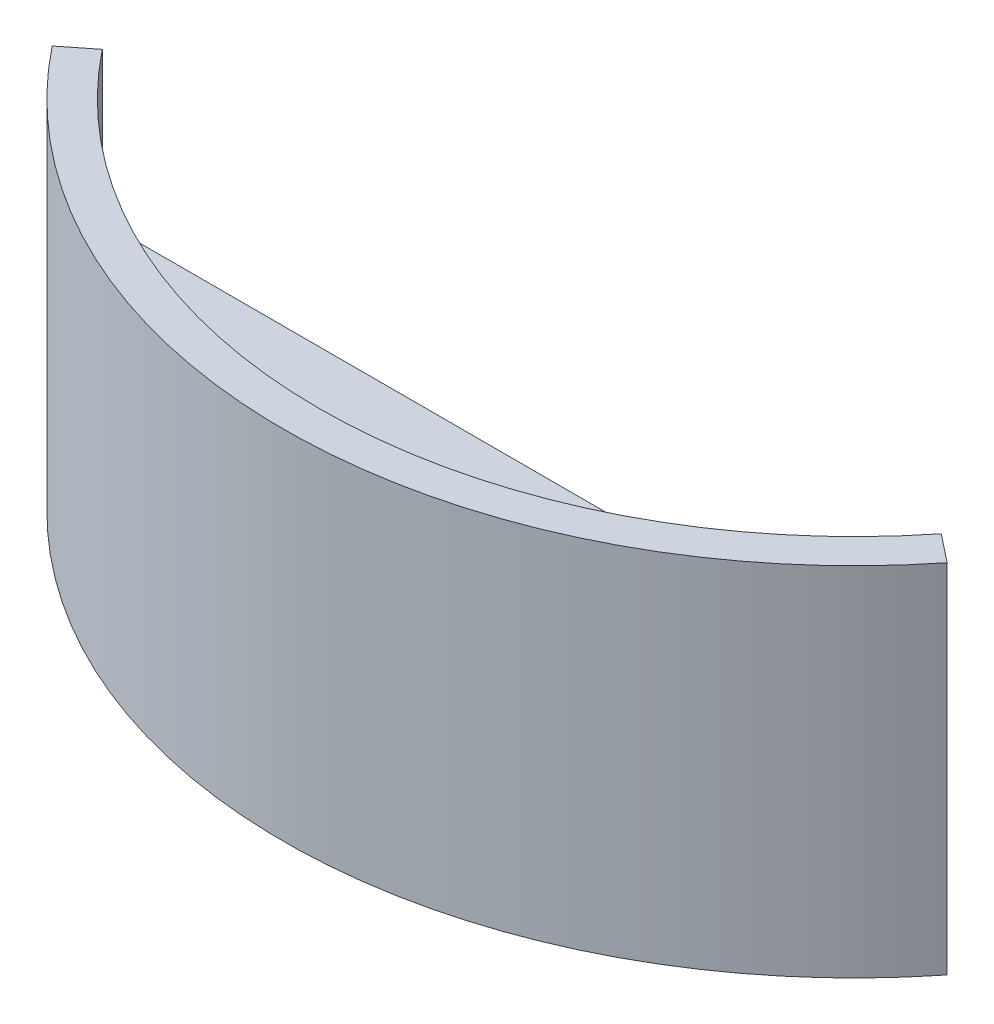
ISO-10303-21;
HEADER;
FILE_DESCRIPTION(('STEP AP214'),'2;1');
FILE_NAME('part.step','',(''),(''),'','','');
FILE_SCHEMA(('AUTOMOTIVE_DESIGN { 1 0 10303 214 1 1 1 1 }'));
ENDSEC;
DATA;
#1=APPLICATION_CONTEXT('core data for automotive mechanical design processes');
#2=APPLICATION_PROTOCOL_DEFINITION('international standard','automotive_design',2000,#1);
#3=PRODUCT_CONTEXT('',#1,'mechanical');
#4=PRODUCT('Part','Part','',(#3));
#5=PRODUCT_RELATED_PRODUCT_CATEGORY('part','',(#4));
#6=PRODUCT_DEFINITION_FORMATION('','',#4);
#7=PRODUCT_DEFINITION_CONTEXT('part definition',#1,'design');
#8=PRODUCT_DEFINITION('design','',#6,#7);
#9=PRODUCT_DEFINITION_SHAPE('','',#8);
#10=(LENGTH_UNIT() NAMED_UNIT(*) SI_UNIT(.MILLI.,.METRE.));
#11=(NAMED_UNIT(*) PLANE_ANGLE_UNIT() SI_UNIT($,.RADIAN.));
#12=(NAMED_UNIT(*) SI_UNIT($,.STERADIAN.) SOLID_ANGLE_UNIT());
#13=UNCERTAINTY_MEASURE_WITH_UNIT(LENGTH_MEASURE(1.E-05),#10,'distance_accuracy_value','');
#14=(GEOMETRIC_REPRESENTATION_CONTEXT(3) GLOBAL_UNCERTAINTY_ASSIGNED_CONTEXT((#13)) GLOBAL_UNIT_ASSIGNED_CONTEXT((#10,
#11,#12)) REPRESENTATION_CONTEXT('',''));
#15=CARTESIAN_POINT('',(0.,0.,0.));
#16=DIRECTION('',(0.,0.,1.));
#17=DIRECTION('',(1.,0.,0.));
#18=AXIS2_PLACEMENT_3D('',#15,#16,#17);
#19=CARTESIAN_POINT('',(0.,10.,-30.));
#20=DIRECTION('',(0.,-1.,0.));
#21=DIRECTION('',(0.,0.,-1.));
#22=AXIS2_PLACEMENT_3D('',#19,#20,#21);
#23=CYLINDRICAL_SURFACE('',#22,30.);
#24=DIRECTION('',(0.,-1.,0.));
#25=VECTOR('',#24,1.);
#26=CARTESIAN_POINT('',(23.2163735324878,2.,-11.));
#27=LINE('',#26,#25);
#28=CARTESIAN_POINT('',(23.2163735324878,2.,-11.));
#29=VERTEX_POINT('',#28);
#30=CARTESIAN_POINT('',(23.2163735324878,-2.,-11.));
#31=VERTEX_POINT('',#30);
#32=EDGE_CURVE('E59',#29,#31,#27,.T.);
#33=ORIENTED_EDGE('',*,*,#32,.F.);
#34=CARTESIAN_POINT('',(0.,2.,-30.));
#35=DIRECTION('',(0.,1.,0.));
#36=DIRECTION('',(0.,0.,1.));
#37=AXIS2_PLACEMENT_3D('',#34,#35,#36);
#38=CIRCLE('',#37,30.);
#39=CARTESIAN_POINT('',(-23.2163735324878,2.,-11.));
#40=VERTEX_POINT('',#39);
#41=EDGE_CURVE('E54',#40,#29,#38,.T.);
#42=ORIENTED_EDGE('',*,*,#41,.F.);
#43=DIRECTION('',(0.,-1.,0.));
#44=VECTOR('',#43,1.);
#45=CARTESIAN_POINT('',(-23.2163735324878,2.,-11.));
#46=LINE('',#45,#44);
#47=CARTESIAN_POINT('',(-23.2163735324878,-2.,-11.));
#48=VERTEX_POINT('',#47);
#49=EDGE_CURVE('E89',#40,#48,#46,.T.);
#50=ORIENTED_EDGE('',*,*,#49,.T.);
#51=CARTESIAN_POINT('',(0.,-2.,-30.));
#52=DIRECTION('',(0.,1.,0.));
#53=DIRECTION('',(0.,0.,1.));
#54=AXIS2_PLACEMENT_3D('',#51,#52,#53);
#55=CIRCLE('',#54,30.);
#56=EDGE_CURVE('E93',#48,#31,#55,.T.);
#57=ORIENTED_EDGE('',*,*,#56,.T.);
#58=EDGE_LOOP('',(#33,#42,#50,#57));
#59=FACE_BOUND('',#58,.T.);
#60=CARTESIAN_POINT('',(0.,-10.,-30.));
#61=DIRECTION('',(0.,-1.,0.));
#62=DIRECTION('',(0.,0.,1.));
#63=AXIS2_PLACEMENT_3D('',#60,#61,#62);
#64=CIRCLE('',#63,30.);
#65=CARTESIAN_POINT('',(23.5,-10.,-11.3519438010285));
#66=VERTEX_POINT('',#65);
#67=CARTESIAN_POINT('',(-23.5,-10.,-11.3519438010285));
#68=VERTEX_POINT('',#67);
#69=EDGE_CURVE('E112',#66,#68,#64,.T.);
#70=ORIENTED_EDGE('',*,*,#69,.T.);
#71=DIRECTION('',(0.,-1.,0.));
#72=VECTOR('',#71,1.);
#73=CARTESIAN_POINT('',(-23.5,10.,-11.3519438010285));
#74=LINE('',#73,#72);
#75=CARTESIAN_POINT('',(-23.5,10.,-11.3519438010285));
#76=VERTEX_POINT('',#75);
#77=EDGE_CURVE('E11',#76,#68,#74,.T.);
#78=ORIENTED_EDGE('',*,*,#77,.F.);
#79=CARTESIAN_POINT('',(0.,10.,-30.));
#80=DIRECTION('',(0.,-1.,0.));
#81=DIRECTION('',(0.,0.,1.));
#82=AXIS2_PLACEMENT_3D('',#79,#80,#81);
#83=CIRCLE('',#82,30.);
#84=CARTESIAN_POINT('',(23.5,10.,-11.3519438010285));
#85=VERTEX_POINT('',#84);
#86=EDGE_CURVE('E113',#85,#76,#83,.T.);
#87=ORIENTED_EDGE('',*,*,#86,.F.);
#88=DIRECTION('',(0.,-1.,0.));
#89=VECTOR('',#88,1.);
#90=CARTESIAN_POINT('',(23.5,10.,-11.3519438010285));
#91=LINE('',#90,#89);
#92=EDGE_CURVE('E127',#85,#66,#91,.T.);
#93=ORIENTED_EDGE('',*,*,#92,.T.);
#94=EDGE_LOOP('',(#70,#78,#87,#93));
#95=FACE_BOUND('',#94,.T.);
#96=ADVANCED_FACE('F39',(#59,#95),#23,.F.);
#97=CARTESIAN_POINT('',(-25.0666666666667,10.,-10.1087400544304));
#98=DIRECTION('',(0.621601873299046,0.,0.783333333333337));
#99=DIRECTION('',(0.783333333333337,0.,-0.621601873299046));
#100=AXIS2_PLACEMENT_3D('',#97,#98,#99);
#101=PLANE('',#100);
#102=DIRECTION('',(-0.783333333333337,0.,0.621601873299046));
#103=VECTOR('',#102,1.);
#104=CARTESIAN_POINT('',(-25.0666666666667,-10.,-10.1087400544304));
#105=LINE('',#104,#103);
#106=CARTESIAN_POINT('',(-25.0666666666667,-10.,-10.1087400544304));
#107=VERTEX_POINT('',#106);
#108=EDGE_CURVE('E131',#68,#107,#105,.T.);
#109=ORIENTED_EDGE('',*,*,#108,.T.);
#110=DIRECTION('',(0.,-1.,0.));
#111=VECTOR('',#110,1.);
#112=CARTESIAN_POINT('',(-25.0666666666667,10.,-10.1087400544304));
#113=LINE('',#112,#111);
#114=CARTESIAN_POINT('',(-25.0666666666667,10.,-10.1087400544304));
#115=VERTEX_POINT('',#114);
#116=EDGE_CURVE('E47',#115,#107,#113,.T.);
#117=ORIENTED_EDGE('',*,*,#116,.F.);
#118=DIRECTION('',(-0.783333333333337,0.,0.621601873299046));
#119=VECTOR('',#118,1.);
#120=CARTESIAN_POINT('',(-25.0666666666667,10.,-10.1087400544304));
#121=LINE('',#120,#119);
#122=EDGE_CURVE('E117',#76,#115,#121,.T.);
#123=ORIENTED_EDGE('',*,*,#122,.F.);
#124=ORIENTED_EDGE('',*,*,#77,.T.);
#125=EDGE_LOOP('',(#109,#117,#123,#124));
#126=FACE_BOUND('',#125,.T.);
#127=ADVANCED_FACE('F166',(#126),#101,.F.);
#128=CARTESIAN_POINT('',(0.,10.,-30.));
#129=DIRECTION('',(0.,-1.,0.));
#130=DIRECTION('',(0.,0.,-1.));
#131=AXIS2_PLACEMENT_3D('',#128,#129,#130);
#132=CYLINDRICAL_SURFACE('',#131,32.);
#133=CARTESIAN_POINT('',(0.,-10.,-30.));
#134=DIRECTION('',(0.,1.,0.));
#135=DIRECTION('',(0.,0.,1.));
#136=AXIS2_PLACEMENT_3D('',#133,#134,#135);
#137=CIRCLE('',#136,32.);
#138=CARTESIAN_POINT('',(25.0666666666667,-10.,-10.1087400544304));
#139=VERTEX_POINT('',#138);
#140=EDGE_CURVE('E134',#107,#139,#137,.T.);
#141=ORIENTED_EDGE('',*,*,#140,.T.);
#142=DIRECTION('',(0.,-1.,0.));
#143=VECTOR('',#142,1.);
#144=CARTESIAN_POINT('',(25.0666666666667,10.,-10.1087400544304));
#145=LINE('',#144,#143);
#146=CARTESIAN_POINT('',(25.0666666666667,10.,-10.1087400544304));
#147=VERTEX_POINT('',#146);
#148=EDGE_CURVE('E142',#147,#139,#145,.T.);
#149=ORIENTED_EDGE('',*,*,#148,.F.);
#150=CARTESIAN_POINT('',(0.,10.,-30.));
#151=DIRECTION('',(0.,1.,0.));
#152=DIRECTION('',(0.,0.,1.));
#153=AXIS2_PLACEMENT_3D('',#150,#151,#152);
#154=CIRCLE('',#153,32.);
#155=EDGE_CURVE('E121',#115,#147,#154,.T.);
#156=ORIENTED_EDGE('',*,*,#155,.F.);
#157=ORIENTED_EDGE('',*,*,#116,.T.);
#158=EDGE_LOOP('',(#141,#149,#156,#157));
#159=FACE_BOUND('',#158,.T.);
#160=ADVANCED_FACE('F151',(#159),#132,.T.);
#161=CARTESIAN_POINT('',(23.5,10.,-11.3519438010285));
#162=DIRECTION('',(-0.621601873299057,0.,0.783333333333328));
#163=DIRECTION('',(0.783333333333328,0.,0.621601873299057));
#164=AXIS2_PLACEMENT_3D('',#161,#162,#163);
#165=PLANE('',#164);
#166=DIRECTION('',(-0.783333333333328,0.,-0.621601873299057));
#167=VECTOR('',#166,1.);
#168=CARTESIAN_POINT('',(23.5,-10.,-11.3519438010285));
#169=LINE('',#168,#167);
#170=EDGE_CURVE('E118',#139,#66,#169,.T.);
#171=ORIENTED_EDGE('',*,*,#170,.T.);
#172=ORIENTED_EDGE('',*,*,#92,.F.);
#173=DIRECTION('',(-0.783333333333328,0.,-0.621601873299057));
#174=VECTOR('',#173,1.);
#175=CARTESIAN_POINT('',(23.5,10.,-11.3519438010285));
#176=LINE('',#175,#174);
#177=EDGE_CURVE('E124',#147,#85,#176,.T.);
#178=ORIENTED_EDGE('',*,*,#177,.F.);
#179=ORIENTED_EDGE('',*,*,#148,.T.);
#180=EDGE_LOOP('',(#171,#172,#178,#179));
#181=FACE_BOUND('',#180,.T.);
#182=ADVANCED_FACE('F160',(#181),#165,.F.);
#183=CARTESIAN_POINT('',(0.,10.,-30.));
#184=DIRECTION('',(0.,1.,0.));
#185=DIRECTION('',(0.,0.,1.));
#186=AXIS2_PLACEMENT_3D('',#183,#184,#185);
#187=PLANE('',#186);
#188=ORIENTED_EDGE('',*,*,#86,.T.);
#189=ORIENTED_EDGE('',*,*,#122,.T.);
#190=ORIENTED_EDGE('',*,*,#155,.T.);
#191=ORIENTED_EDGE('',*,*,#177,.T.);
#192=EDGE_LOOP('',(#188,#189,#190,#191));
#193=FACE_BOUND('',#192,.T.);
#194=ADVANCED_FACE('F165',(#193),#187,.T.);
#195=CARTESIAN_POINT('',(0.,-10.,-30.));
#196=DIRECTION('',(0.,1.,0.));
#197=DIRECTION('',(0.,0.,1.));
#198=AXIS2_PLACEMENT_3D('',#195,#196,#197);
#199=PLANE('',#198);
#200=ORIENTED_EDGE('',*,*,#69,.F.);
#201=ORIENTED_EDGE('',*,*,#170,.F.);
#202=ORIENTED_EDGE('',*,*,#140,.F.);
#203=ORIENTED_EDGE('',*,*,#108,.F.);
#204=EDGE_LOOP('',(#200,#201,#202,#203));
#205=FACE_BOUND('',#204,.T.);
#206=ADVANCED_FACE('F157',(#205),#199,.F.);
#207=CARTESIAN_POINT('',(-23.2163735324878,2.,-11.));
#208=DIRECTION('',(0.,0.,1.));
#209=DIRECTION('',(1.,0.,0.));
#210=AXIS2_PLACEMENT_3D('',#207,#208,#209);
#211=PLANE('',#210);
#212=DIRECTION('',(-1.,0.,0.));
#213=VECTOR('',#212,1.);
#214=CARTESIAN_POINT('',(-23.2163735324878,-2.,-11.));
#215=LINE('',#214,#213);
#216=EDGE_CURVE('E99',#31,#48,#215,.T.);
#217=ORIENTED_EDGE('',*,*,#216,.T.);
#218=ORIENTED_EDGE('',*,*,#49,.F.);
#219=DIRECTION('',(-1.,0.,0.));
#220=VECTOR('',#219,1.);
#221=CARTESIAN_POINT('',(-23.2163735324878,2.,-11.));
#222=LINE('',#221,#220);
#223=EDGE_CURVE('E97',#29,#40,#222,.T.);
#224=ORIENTED_EDGE('',*,*,#223,.F.);
#225=ORIENTED_EDGE('',*,*,#32,.T.);
#226=EDGE_LOOP('',(#217,#218,#224,#225));
#227=FACE_BOUND('',#226,.T.);
#228=ADVANCED_FACE('F100',(#227),#211,.F.);
#229=CARTESIAN_POINT('',(0.,2.,-30.));
#230=DIRECTION('',(0.,1.,0.));
#231=DIRECTION('',(0.,0.,1.));
#232=AXIS2_PLACEMENT_3D('',#229,#230,#231);
#233=PLANE('',#232);
#234=ORIENTED_EDGE('',*,*,#41,.T.);
#235=ORIENTED_EDGE('',*,*,#223,.T.);
#236=EDGE_LOOP('',(#234,#235));
#237=FACE_BOUND('',#236,.T.);
#238=ADVANCED_FACE('F182',(#237),#233,.T.);
#239=CARTESIAN_POINT('',(0.,-2.,-30.));
#240=DIRECTION('',(0.,1.,0.));
#241=DIRECTION('',(0.,0.,1.));
#242=AXIS2_PLACEMENT_3D('',#239,#240,#241);
#243=PLANE('',#242);
#244=ORIENTED_EDGE('',*,*,#56,.F.);
#245=ORIENTED_EDGE('',*,*,#216,.F.);
#246=EDGE_LOOP('',(#244,#245));
#247=FACE_BOUND('',#246,.T.);
#248=ADVANCED_FACE('F104',(#247),#243,.F.);
#249=CLOSED_SHELL('',(#96,#127,#160,#182,#194,#206,#228,#238,#248));
#250=MANIFOLD_SOLID_BREP('B2',#249);
#251=ADVANCED_BREP_SHAPE_REPRESENTATION('',(#18,#250),#14);
#252=SHAPE_DEFINITION_REPRESENTATION(#9,#251);
ENDSEC;
END-ISO-10303-21;
